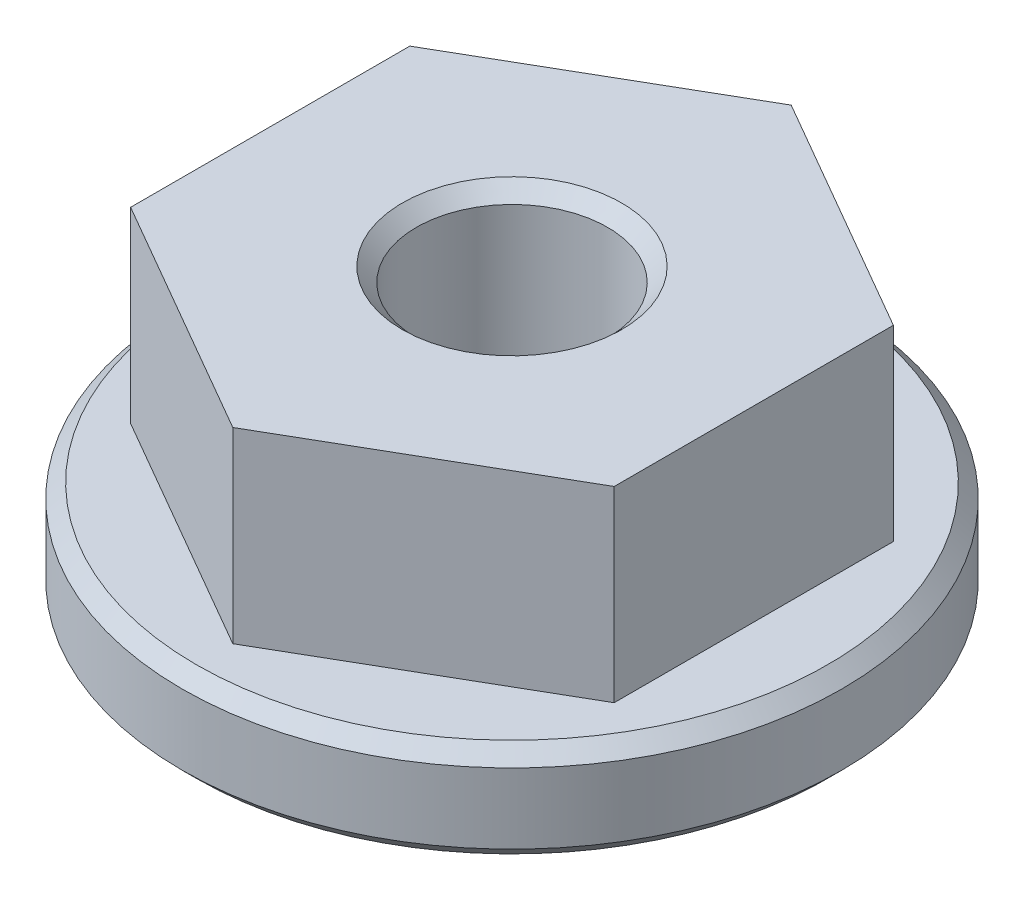
ISO-10303-21;
HEADER;
FILE_DESCRIPTION(('STEP AP214'),'2;1');
FILE_NAME('part.step','',(''),(''),'','','');
FILE_SCHEMA(('AUTOMOTIVE_DESIGN { 1 0 10303 214 1 1 1 1 }'));
ENDSEC;
DATA;
#1=APPLICATION_CONTEXT('core data for automotive mechanical design processes');
#2=APPLICATION_PROTOCOL_DEFINITION('international standard','automotive_design',2000,#1);
#3=PRODUCT_CONTEXT('',#1,'mechanical');
#4=PRODUCT('Part','Part','',(#3));
#5=PRODUCT_RELATED_PRODUCT_CATEGORY('part','',(#4));
#6=PRODUCT_DEFINITION_FORMATION('','',#4);
#7=PRODUCT_DEFINITION_CONTEXT('part definition',#1,'design');
#8=PRODUCT_DEFINITION('design','',#6,#7);
#9=PRODUCT_DEFINITION_SHAPE('','',#8);
#10=(LENGTH_UNIT() NAMED_UNIT(*) SI_UNIT(.MILLI.,.METRE.));
#11=(NAMED_UNIT(*) PLANE_ANGLE_UNIT() SI_UNIT($,.RADIAN.));
#12=(NAMED_UNIT(*) SI_UNIT($,.STERADIAN.) SOLID_ANGLE_UNIT());
#13=UNCERTAINTY_MEASURE_WITH_UNIT(LENGTH_MEASURE(1.E-05),#10,'distance_accuracy_value','');
#14=(GEOMETRIC_REPRESENTATION_CONTEXT(3) GLOBAL_UNCERTAINTY_ASSIGNED_CONTEXT((#13)) GLOBAL_UNIT_ASSIGNED_CONTEXT((#10,
#11,#12)) REPRESENTATION_CONTEXT('',''));
#15=CARTESIAN_POINT('',(0.,0.,0.));
#16=DIRECTION('',(0.,0.,1.));
#17=DIRECTION('',(1.,0.,0.));
#18=AXIS2_PLACEMENT_3D('',#15,#16,#17);
#19=CARTESIAN_POINT('',(0.,1.778,0.));
#20=DIRECTION('',(0.,1.,0.));
#21=DIRECTION('',(0.,0.,1.));
#22=AXIS2_PLACEMENT_3D('',#19,#20,#21);
#23=PLANE('',#22);
#24=CARTESIAN_POINT('',(0.,1.778,0.));
#25=DIRECTION('',(0.,1.,0.));
#26=DIRECTION('',(0.,0.,1.));
#27=AXIS2_PLACEMENT_3D('',#24,#25,#26);
#28=CIRCLE('',#27,5.699125);
#29=CARTESIAN_POINT('',(0.,1.778,5.699125));
#30=VERTEX_POINT('',#29);
#31=EDGE_CURVE('E140',#30,#30,#28,.T.);
#32=ORIENTED_EDGE('',*,*,#31,.T.);
#33=EDGE_LOOP('',(#32));
#34=FACE_BOUND('',#33,.T.);
#35=DIRECTION('',(0.,0.,-1.));
#36=VECTOR('',#35,1.);
#37=CARTESIAN_POINT('',(4.365625,1.778,2.52049476893096));
#38=LINE('',#37,#36);
#39=CARTESIAN_POINT('',(4.365625,1.778,2.52049476893096));
#40=VERTEX_POINT('',#39);
#41=CARTESIAN_POINT('',(4.365625,1.778,-2.52049476893096));
#42=VERTEX_POINT('',#41);
#43=EDGE_CURVE('E123',#40,#42,#38,.T.);
#44=ORIENTED_EDGE('',*,*,#43,.F.);
#45=DIRECTION('',(0.866025403784439,0.,-0.5));
#46=VECTOR('',#45,1.);
#47=CARTESIAN_POINT('',(0.,1.778,5.04098953786192));
#48=LINE('',#47,#46);
#49=CARTESIAN_POINT('',(0.,1.778,5.04098953786192));
#50=VERTEX_POINT('',#49);
#51=EDGE_CURVE('E120',#50,#40,#48,.T.);
#52=ORIENTED_EDGE('',*,*,#51,.F.);
#53=DIRECTION('',(0.866025403784439,0.,0.5));
#54=VECTOR('',#53,1.);
#55=CARTESIAN_POINT('',(-4.365625,1.778,2.52049476893096));
#56=LINE('',#55,#54);
#57=CARTESIAN_POINT('',(-4.365625,1.778,2.52049476893096));
#58=VERTEX_POINT('',#57);
#59=EDGE_CURVE('E79',#58,#50,#56,.T.);
#60=ORIENTED_EDGE('',*,*,#59,.F.);
#61=DIRECTION('',(0.,0.,1.));
#62=VECTOR('',#61,1.);
#63=CARTESIAN_POINT('',(-4.365625,1.778,-2.52049476893096));
#64=LINE('',#63,#62);
#65=CARTESIAN_POINT('',(-4.365625,1.778,-2.52049476893096));
#66=VERTEX_POINT('',#65);
#67=EDGE_CURVE('E128',#66,#58,#64,.T.);
#68=ORIENTED_EDGE('',*,*,#67,.F.);
#69=DIRECTION('',(-0.866025403784439,0.,0.5));
#70=VECTOR('',#69,1.);
#71=CARTESIAN_POINT('',(0.,1.778,-5.04098953786192));
#72=LINE('',#71,#70);
#73=CARTESIAN_POINT('',(0.,1.778,-5.04098953786192));
#74=VERTEX_POINT('',#73);
#75=EDGE_CURVE('E109',#74,#66,#72,.T.);
#76=ORIENTED_EDGE('',*,*,#75,.F.);
#77=DIRECTION('',(-0.866025403784439,0.,-0.5));
#78=VECTOR('',#77,1.);
#79=CARTESIAN_POINT('',(4.365625,1.778,-2.52049476893096));
#80=LINE('',#79,#78);
#81=EDGE_CURVE('E125',#42,#74,#80,.T.);
#82=ORIENTED_EDGE('',*,*,#81,.F.);
#83=EDGE_LOOP('',(#44,#52,#60,#68,#76,#82));
#84=FACE_BOUND('',#83,.T.);
#85=ADVANCED_FACE('F36',(#34,#84),#23,.T.);
#86=CARTESIAN_POINT('',(0.,1.778,0.));
#87=DIRECTION('',(0.,-1.,0.));
#88=DIRECTION('',(0.,0.,-1.));
#89=AXIS2_PLACEMENT_3D('',#86,#87,#88);
#90=CYLINDRICAL_SURFACE('',#89,5.953125);
#91=CARTESIAN_POINT('',(0.,1.524,0.));
#92=DIRECTION('',(0.,1.,0.));
#93=DIRECTION('',(0.,0.,1.));
#94=AXIS2_PLACEMENT_3D('',#91,#92,#93);
#95=CIRCLE('',#94,5.953125);
#96=CARTESIAN_POINT('',(0.,1.524,5.953125));
#97=VERTEX_POINT('',#96);
#98=EDGE_CURVE('E146',#97,#97,#95,.F.);
#99=ORIENTED_EDGE('',*,*,#98,.T.);
#100=EDGE_LOOP('',(#99));
#101=FACE_BOUND('',#100,.T.);
#102=CARTESIAN_POINT('',(0.,0.254000000000002,0.));
#103=DIRECTION('',(0.,1.,0.));
#104=DIRECTION('',(0.,0.,1.));
#105=AXIS2_PLACEMENT_3D('',#102,#103,#104);
#106=CIRCLE('',#105,5.953125);
#107=CARTESIAN_POINT('',(0.,0.254000000000002,5.953125));
#108=VERTEX_POINT('',#107);
#109=EDGE_CURVE('E143',#108,#108,#106,.T.);
#110=ORIENTED_EDGE('',*,*,#109,.T.);
#111=EDGE_LOOP('',(#110));
#112=FACE_BOUND('',#111,.T.);
#113=ADVANCED_FACE('F172',(#101,#112),#90,.T.);
#114=CARTESIAN_POINT('',(0.,0.,0.));
#115=DIRECTION('',(0.,1.,0.));
#116=DIRECTION('',(0.,0.,1.));
#117=AXIS2_PLACEMENT_3D('',#114,#115,#116);
#118=PLANE('',#117);
#119=CARTESIAN_POINT('',(0.,0.,0.));
#120=DIRECTION('',(0.,1.,0.));
#121=DIRECTION('',(0.,0.,1.));
#122=AXIS2_PLACEMENT_3D('',#119,#120,#121);
#123=CIRCLE('',#122,5.699125);
#124=CARTESIAN_POINT('',(0.,0.,5.699125));
#125=VERTEX_POINT('',#124);
#126=EDGE_CURVE('E152',#125,#125,#123,.F.);
#127=ORIENTED_EDGE('',*,*,#126,.T.);
#128=EDGE_LOOP('',(#127));
#129=FACE_BOUND('',#128,.T.);
#130=CARTESIAN_POINT('',(0.,0.,0.));
#131=DIRECTION('',(0.,1.,0.));
#132=DIRECTION('',(0.,0.,1.));
#133=AXIS2_PLACEMENT_3D('',#130,#131,#132);
#134=CIRCLE('',#133,1.98119999999997);
#135=CARTESIAN_POINT('',(0.,0.,1.98119999999997));
#136=VERTEX_POINT('',#135);
#137=EDGE_CURVE('E149',#136,#136,#134,.T.);
#138=ORIENTED_EDGE('',*,*,#137,.T.);
#139=EDGE_LOOP('',(#138));
#140=FACE_BOUND('',#139,.T.);
#141=ADVANCED_FACE('F169',(#129,#140),#118,.F.);
#142=CARTESIAN_POINT('',(0.,5.159375,5.04098953786192));
#143=DIRECTION('',(-0.5,0.,-0.866025403784439));
#144=DIRECTION('',(-0.866025403784439,0.,0.5));
#145=AXIS2_PLACEMENT_3D('',#142,#143,#144);
#146=PLANE('',#145);
#147=ORIENTED_EDGE('',*,*,#51,.T.);
#148=DIRECTION('',(0.,-1.,0.));
#149=VECTOR('',#148,1.);
#150=CARTESIAN_POINT('',(4.365625,5.159375,2.52049476893096));
#151=LINE('',#150,#149);
#152=CARTESIAN_POINT('',(4.365625,5.159375,2.52049476893096));
#153=VERTEX_POINT('',#152);
#154=EDGE_CURVE('E138',#153,#40,#151,.T.);
#155=ORIENTED_EDGE('',*,*,#154,.F.);
#156=DIRECTION('',(0.866025403784439,0.,-0.5));
#157=VECTOR('',#156,1.);
#158=CARTESIAN_POINT('',(0.,5.159375,5.04098953786192));
#159=LINE('',#158,#157);
#160=CARTESIAN_POINT('',(0.,5.159375,5.04098953786192));
#161=VERTEX_POINT('',#160);
#162=EDGE_CURVE('E131',#161,#153,#159,.T.);
#163=ORIENTED_EDGE('',*,*,#162,.F.);
#164=DIRECTION('',(0.,-1.,0.));
#165=VECTOR('',#164,1.);
#166=CARTESIAN_POINT('',(0.,5.159375,5.04098953786192));
#167=LINE('',#166,#165);
#168=EDGE_CURVE('E116',#161,#50,#167,.T.);
#169=ORIENTED_EDGE('',*,*,#168,.T.);
#170=EDGE_LOOP('',(#147,#155,#163,#169));
#171=FACE_BOUND('',#170,.T.);
#172=ADVANCED_FACE('F171',(#171),#146,.F.);
#173=CARTESIAN_POINT('',(4.365625,5.159375,2.52049476893096));
#174=DIRECTION('',(-1.,0.,0.));
#175=DIRECTION('',(0.,0.,1.));
#176=AXIS2_PLACEMENT_3D('',#173,#174,#175);
#177=PLANE('',#176);
#178=ORIENTED_EDGE('',*,*,#43,.T.);
#179=DIRECTION('',(0.,-1.,0.));
#180=VECTOR('',#179,1.);
#181=CARTESIAN_POINT('',(4.365625,5.159375,-2.52049476893096));
#182=LINE('',#181,#180);
#183=CARTESIAN_POINT('',(4.365625,5.159375,-2.52049476893096));
#184=VERTEX_POINT('',#183);
#185=EDGE_CURVE('E135',#184,#42,#182,.T.);
#186=ORIENTED_EDGE('',*,*,#185,.F.);
#187=DIRECTION('',(0.,0.,-1.));
#188=VECTOR('',#187,1.);
#189=CARTESIAN_POINT('',(4.365625,5.159375,2.52049476893096));
#190=LINE('',#189,#188);
#191=EDGE_CURVE('E87',#153,#184,#190,.T.);
#192=ORIENTED_EDGE('',*,*,#191,.F.);
#193=ORIENTED_EDGE('',*,*,#154,.T.);
#194=EDGE_LOOP('',(#178,#186,#192,#193));
#195=FACE_BOUND('',#194,.T.);
#196=ADVANCED_FACE('F179',(#195),#177,.F.);
#197=CARTESIAN_POINT('',(4.365625,5.159375,-2.52049476893096));
#198=DIRECTION('',(-0.5,0.,0.866025403784439));
#199=DIRECTION('',(0.866025403784439,0.,0.5));
#200=AXIS2_PLACEMENT_3D('',#197,#198,#199);
#201=PLANE('',#200);
#202=ORIENTED_EDGE('',*,*,#81,.T.);
#203=DIRECTION('',(0.,-1.,0.));
#204=VECTOR('',#203,1.);
#205=CARTESIAN_POINT('',(0.,5.159375,-5.04098953786192));
#206=LINE('',#205,#204);
#207=CARTESIAN_POINT('',(0.,5.159375,-5.04098953786192));
#208=VERTEX_POINT('',#207);
#209=EDGE_CURVE('E112',#208,#74,#206,.T.);
#210=ORIENTED_EDGE('',*,*,#209,.F.);
#211=DIRECTION('',(-0.866025403784439,0.,-0.5));
#212=VECTOR('',#211,1.);
#213=CARTESIAN_POINT('',(4.365625,5.159375,-2.52049476893096));
#214=LINE('',#213,#212);
#215=EDGE_CURVE('E100',#184,#208,#214,.T.);
#216=ORIENTED_EDGE('',*,*,#215,.F.);
#217=ORIENTED_EDGE('',*,*,#185,.T.);
#218=EDGE_LOOP('',(#202,#210,#216,#217));
#219=FACE_BOUND('',#218,.T.);
#220=ADVANCED_FACE('F193',(#219),#201,.F.);
#221=CARTESIAN_POINT('',(0.,5.159375,-5.04098953786192));
#222=DIRECTION('',(0.5,0.,0.866025403784439));
#223=DIRECTION('',(0.866025403784439,0.,-0.5));
#224=AXIS2_PLACEMENT_3D('',#221,#222,#223);
#225=PLANE('',#224);
#226=ORIENTED_EDGE('',*,*,#75,.T.);
#227=DIRECTION('',(0.,-1.,0.));
#228=VECTOR('',#227,1.);
#229=CARTESIAN_POINT('',(-4.365625,5.159375,-2.52049476893096));
#230=LINE('',#229,#228);
#231=CARTESIAN_POINT('',(-4.365625,5.159375,-2.52049476893096));
#232=VERTEX_POINT('',#231);
#233=EDGE_CURVE('E106',#232,#66,#230,.T.);
#234=ORIENTED_EDGE('',*,*,#233,.F.);
#235=DIRECTION('',(-0.866025403784439,0.,0.5));
#236=VECTOR('',#235,1.);
#237=CARTESIAN_POINT('',(0.,5.159375,-5.04098953786192));
#238=LINE('',#237,#236);
#239=EDGE_CURVE('E94',#208,#232,#238,.T.);
#240=ORIENTED_EDGE('',*,*,#239,.F.);
#241=ORIENTED_EDGE('',*,*,#209,.T.);
#242=EDGE_LOOP('',(#226,#234,#240,#241));
#243=FACE_BOUND('',#242,.T.);
#244=ADVANCED_FACE('F107',(#243),#225,.F.);
#245=CARTESIAN_POINT('',(-4.365625,5.159375,-2.52049476893096));
#246=DIRECTION('',(1.,0.,0.));
#247=DIRECTION('',(0.,0.,-1.));
#248=AXIS2_PLACEMENT_3D('',#245,#246,#247);
#249=PLANE('',#248);
#250=ORIENTED_EDGE('',*,*,#67,.T.);
#251=DIRECTION('',(0.,-1.,0.));
#252=VECTOR('',#251,1.);
#253=CARTESIAN_POINT('',(-4.365625,5.159375,2.52049476893096));
#254=LINE('',#253,#252);
#255=CARTESIAN_POINT('',(-4.365625,5.159375,2.52049476893096));
#256=VERTEX_POINT('',#255);
#257=EDGE_CURVE('E51',#256,#58,#254,.T.);
#258=ORIENTED_EDGE('',*,*,#257,.F.);
#259=DIRECTION('',(0.,0.,1.));
#260=VECTOR('',#259,1.);
#261=CARTESIAN_POINT('',(-4.365625,5.159375,-2.52049476893096));
#262=LINE('',#261,#260);
#263=EDGE_CURVE('E98',#232,#256,#262,.T.);
#264=ORIENTED_EDGE('',*,*,#263,.F.);
#265=ORIENTED_EDGE('',*,*,#233,.T.);
#266=EDGE_LOOP('',(#250,#258,#264,#265));
#267=FACE_BOUND('',#266,.T.);
#268=ADVANCED_FACE('F114',(#267),#249,.F.);
#269=CARTESIAN_POINT('',(-4.365625,5.159375,2.52049476893096));
#270=DIRECTION('',(0.5,0.,-0.866025403784439));
#271=DIRECTION('',(-0.866025403784439,0.,-0.5));
#272=AXIS2_PLACEMENT_3D('',#269,#270,#271);
#273=PLANE('',#272);
#274=ORIENTED_EDGE('',*,*,#59,.T.);
#275=ORIENTED_EDGE('',*,*,#168,.F.);
#276=DIRECTION('',(0.866025403784439,0.,0.5));
#277=VECTOR('',#276,1.);
#278=CARTESIAN_POINT('',(-4.365625,5.159375,2.52049476893096));
#279=LINE('',#278,#277);
#280=EDGE_CURVE('E59',#256,#161,#279,.T.);
#281=ORIENTED_EDGE('',*,*,#280,.F.);
#282=ORIENTED_EDGE('',*,*,#257,.T.);
#283=EDGE_LOOP('',(#274,#275,#281,#282));
#284=FACE_BOUND('',#283,.T.);
#285=ADVANCED_FACE('F201',(#284),#273,.F.);
#286=CARTESIAN_POINT('',(0.,5.159375,0.));
#287=DIRECTION('',(0.,1.,0.));
#288=DIRECTION('',(0.,0.,1.));
#289=AXIS2_PLACEMENT_3D('',#286,#287,#288);
#290=PLANE('',#289);
#291=CARTESIAN_POINT('',(0.,5.159375,0.));
#292=DIRECTION('',(0.,1.,0.));
#293=DIRECTION('',(0.,0.,1.));
#294=AXIS2_PLACEMENT_3D('',#291,#292,#293);
#295=CIRCLE('',#294,1.98119999999994);
#296=CARTESIAN_POINT('',(0.,5.159375,1.98119999999994));
#297=VERTEX_POINT('',#296);
#298=EDGE_CURVE('E11',#297,#297,#295,.F.);
#299=ORIENTED_EDGE('',*,*,#298,.T.);
#300=EDGE_LOOP('',(#299));
#301=FACE_BOUND('',#300,.T.);
#302=ORIENTED_EDGE('',*,*,#162,.T.);
#303=ORIENTED_EDGE('',*,*,#191,.T.);
#304=ORIENTED_EDGE('',*,*,#215,.T.);
#305=ORIENTED_EDGE('',*,*,#239,.T.);
#306=ORIENTED_EDGE('',*,*,#263,.T.);
#307=ORIENTED_EDGE('',*,*,#280,.T.);
#308=EDGE_LOOP('',(#302,#303,#304,#305,#306,#307));
#309=FACE_BOUND('',#308,.T.);
#310=ADVANCED_FACE('F96',(#301,#309),#290,.T.);
#311=CARTESIAN_POINT('',(0.,5.159375,0.));
#312=DIRECTION('',(0.,1.,0.));
#313=DIRECTION('',(0.,0.,1.));
#314=AXIS2_PLACEMENT_3D('',#311,#312,#313);
#315=CYLINDRICAL_SURFACE('',#314,1.72719999999994);
#316=CARTESIAN_POINT('',(0.,0.254000000000033,0.));
#317=DIRECTION('',(0.,1.,0.));
#318=DIRECTION('',(0.,0.,1.));
#319=AXIS2_PLACEMENT_3D('',#316,#317,#318);
#320=CIRCLE('',#319,1.72719999999994);
#321=CARTESIAN_POINT('',(0.,0.254000000000033,1.72719999999994));
#322=VERTEX_POINT('',#321);
#323=EDGE_CURVE('E44',#322,#322,#320,.F.);
#324=ORIENTED_EDGE('',*,*,#323,.T.);
#325=EDGE_LOOP('',(#324));
#326=FACE_BOUND('',#325,.T.);
#327=CARTESIAN_POINT('',(0.,4.905375,0.));
#328=DIRECTION('',(0.,1.,0.));
#329=DIRECTION('',(0.,0.,1.));
#330=AXIS2_PLACEMENT_3D('',#327,#328,#329);
#331=CIRCLE('',#330,1.72719999999994);
#332=CARTESIAN_POINT('',(0.,4.905375,1.72719999999994));
#333=VERTEX_POINT('',#332);
#334=EDGE_CURVE('E155',#333,#333,#331,.T.);
#335=ORIENTED_EDGE('',*,*,#334,.T.);
#336=EDGE_LOOP('',(#335));
#337=FACE_BOUND('',#336,.T.);
#338=ADVANCED_FACE('F160',(#326,#337),#315,.F.);
#339=CARTESIAN_POINT('',(0.,1.778,0.));
#340=DIRECTION('',(0.,-1.,0.));
#341=DIRECTION('',(0.,0.,-1.));
#342=AXIS2_PLACEMENT_3D('',#339,#340,#341);
#343=CONICAL_SURFACE('',#342,5.699125,0.785398163397442);
#344=ORIENTED_EDGE('',*,*,#98,.F.);
#345=EDGE_LOOP('',(#344));
#346=FACE_BOUND('',#345,.T.);
#347=ORIENTED_EDGE('',*,*,#31,.F.);
#348=EDGE_LOOP('',(#347));
#349=FACE_BOUND('',#348,.T.);
#350=ADVANCED_FACE('F208',(#346,#349),#343,.T.);
#351=CARTESIAN_POINT('',(0.,0.254000000000002,0.));
#352=DIRECTION('',(0.,1.,0.));
#353=DIRECTION('',(0.,0.,1.));
#354=AXIS2_PLACEMENT_3D('',#351,#352,#353);
#355=CONICAL_SURFACE('',#354,5.953125,0.78539816339745);
#356=ORIENTED_EDGE('',*,*,#126,.F.);
#357=EDGE_LOOP('',(#356));
#358=FACE_BOUND('',#357,.T.);
#359=ORIENTED_EDGE('',*,*,#109,.F.);
#360=EDGE_LOOP('',(#359));
#361=FACE_BOUND('',#360,.T.);
#362=ADVANCED_FACE('F166',(#358,#361),#355,.T.);
#363=CARTESIAN_POINT('',(0.,0.,0.));
#364=DIRECTION('',(0.,-1.,0.));
#365=DIRECTION('',(0.,0.,-1.));
#366=AXIS2_PLACEMENT_3D('',#363,#364,#365);
#367=CONICAL_SURFACE('',#366,1.98119999999997,0.785398163397447);
#368=ORIENTED_EDGE('',*,*,#323,.F.);
#369=EDGE_LOOP('',(#368));
#370=FACE_BOUND('',#369,.T.);
#371=ORIENTED_EDGE('',*,*,#137,.F.);
#372=EDGE_LOOP('',(#371));
#373=FACE_BOUND('',#372,.T.);
#374=ADVANCED_FACE('F163',(#370,#373),#367,.F.);
#375=CARTESIAN_POINT('',(0.,4.905375,0.));
#376=DIRECTION('',(0.,1.,0.));
#377=DIRECTION('',(0.,0.,1.));
#378=AXIS2_PLACEMENT_3D('',#375,#376,#377);
#379=CONICAL_SURFACE('',#378,1.72719999999994,0.785398163397449);
#380=ORIENTED_EDGE('',*,*,#298,.F.);
#381=EDGE_LOOP('',(#380));
#382=FACE_BOUND('',#381,.T.);
#383=ORIENTED_EDGE('',*,*,#334,.F.);
#384=EDGE_LOOP('',(#383));
#385=FACE_BOUND('',#384,.T.);
#386=ADVANCED_FACE('F38',(#382,#385),#379,.F.);
#387=CLOSED_SHELL('',(#85,#113,#141,#172,#196,#220,#244,#268,#285,#310,#338,#350,#362,#374,#386));
#388=MANIFOLD_SOLID_BREP('B2',#387);
#389=ADVANCED_BREP_SHAPE_REPRESENTATION('',(#18,#388),#14);
#390=SHAPE_DEFINITION_REPRESENTATION(#9,#389);
ENDSEC;
END-ISO-10303-21;
